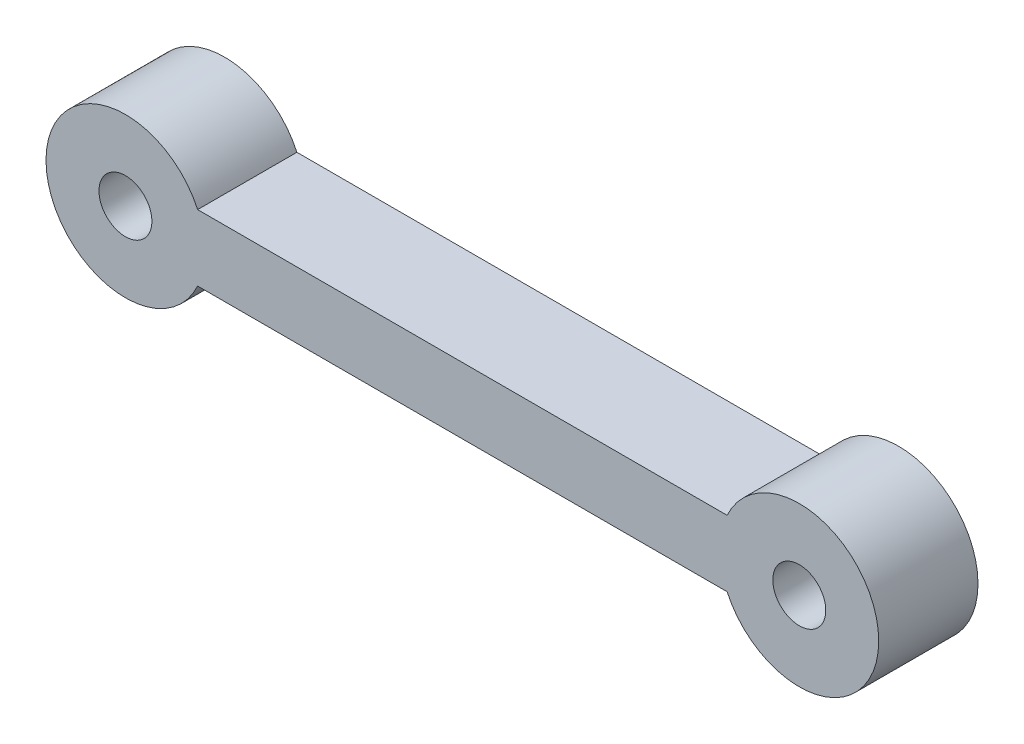
ISO-10303-21;
HEADER;
FILE_DESCRIPTION(('STEP AP214'),'2;1');
FILE_NAME('part.step','',(''),(''),'','','');
FILE_SCHEMA(('AUTOMOTIVE_DESIGN { 1 0 10303 214 1 1 1 1 }'));
ENDSEC;
DATA;
#1=APPLICATION_CONTEXT('core data for automotive mechanical design processes');
#2=APPLICATION_PROTOCOL_DEFINITION('international standard','automotive_design',2000,#1);
#3=PRODUCT_CONTEXT('',#1,'mechanical');
#4=PRODUCT('Part','Part','',(#3));
#5=PRODUCT_RELATED_PRODUCT_CATEGORY('part','',(#4));
#6=PRODUCT_DEFINITION_FORMATION('','',#4);
#7=PRODUCT_DEFINITION_CONTEXT('part definition',#1,'design');
#8=PRODUCT_DEFINITION('design','',#6,#7);
#9=PRODUCT_DEFINITION_SHAPE('','',#8);
#10=(LENGTH_UNIT() NAMED_UNIT(*) SI_UNIT(.MILLI.,.METRE.));
#11=(NAMED_UNIT(*) PLANE_ANGLE_UNIT() SI_UNIT($,.RADIAN.));
#12=(NAMED_UNIT(*) SI_UNIT($,.STERADIAN.) SOLID_ANGLE_UNIT());
#13=UNCERTAINTY_MEASURE_WITH_UNIT(LENGTH_MEASURE(1.E-05),#10,'distance_accuracy_value','');
#14=(GEOMETRIC_REPRESENTATION_CONTEXT(3) GLOBAL_UNCERTAINTY_ASSIGNED_CONTEXT((#13)) GLOBAL_UNIT_ASSIGNED_CONTEXT((#10,
#11,#12)) REPRESENTATION_CONTEXT('',''));
#15=CARTESIAN_POINT('',(0.,0.,0.));
#16=DIRECTION('',(0.,0.,1.));
#17=DIRECTION('',(1.,0.,0.));
#18=AXIS2_PLACEMENT_3D('',#15,#16,#17);
#19=CARTESIAN_POINT('',(-50.9087121146357,-5.00000000000001,15.));
#20=DIRECTION('',(0.,0.,1.));
#21=DIRECTION('',(1.,0.,0.));
#22=AXIS2_PLACEMENT_3D('',#19,#20,#21);
#23=PLANE('',#22);
#24=CARTESIAN_POINT('',(-50.9087121146357,-5.00000000000001,15.));
#25=DIRECTION('',(0.,0.,1.));
#26=DIRECTION('',(1.,0.,0.));
#27=AXIS2_PLACEMENT_3D('',#24,#25,#26);
#28=CIRCLE('',#27,4.);
#29=CARTESIAN_POINT('',(-46.9087121146357,-5.00000000000001,15.));
#30=VERTEX_POINT('',#29);
#31=EDGE_CURVE('E101',#30,#30,#28,.T.);
#32=ORIENTED_EDGE('',*,*,#31,.F.);
#33=EDGE_LOOP('',(#32));
#34=FACE_BOUND('',#33,.T.);
#35=CARTESIAN_POINT('',(-50.9087121146357,-5.00000000000001,15.));
#36=DIRECTION('',(0.,0.,1.));
#37=DIRECTION('',(1.,0.,0.));
#38=AXIS2_PLACEMENT_3D('',#35,#36,#37);
#39=CIRCLE('',#38,12.);
#40=CARTESIAN_POINT('',(-40.,0.,15.));
#41=VERTEX_POINT('',#40);
#42=CARTESIAN_POINT('',(-40.,-10.,15.));
#43=VERTEX_POINT('',#42);
#44=EDGE_CURVE('E86',#41,#43,#39,.T.);
#45=ORIENTED_EDGE('',*,*,#44,.T.);
#46=DIRECTION('',(1.,0.,0.));
#47=VECTOR('',#46,1.);
#48=CARTESIAN_POINT('',(-40.,-10.,15.));
#49=LINE('',#48,#47);
#50=CARTESIAN_POINT('',(40.,-10.,15.));
#51=VERTEX_POINT('',#50);
#52=EDGE_CURVE('E81',#43,#51,#49,.T.);
#53=ORIENTED_EDGE('',*,*,#52,.T.);
#54=CARTESIAN_POINT('',(50.9087121146357,-5.00000000000001,15.));
#55=DIRECTION('',(0.,0.,1.));
#56=DIRECTION('',(-1.,0.,0.));
#57=AXIS2_PLACEMENT_3D('',#54,#55,#56);
#58=CIRCLE('',#57,12.);
#59=CARTESIAN_POINT('',(40.,0.,15.));
#60=VERTEX_POINT('',#59);
#61=EDGE_CURVE('E84',#51,#60,#58,.T.);
#62=ORIENTED_EDGE('',*,*,#61,.T.);
#63=DIRECTION('',(-1.,0.,0.));
#64=VECTOR('',#63,1.);
#65=CARTESIAN_POINT('',(40.,0.,15.));
#66=LINE('',#65,#64);
#67=EDGE_CURVE('E51',#60,#41,#66,.T.);
#68=ORIENTED_EDGE('',*,*,#67,.T.);
#69=EDGE_LOOP('',(#45,#53,#62,#68));
#70=FACE_BOUND('',#69,.T.);
#71=CARTESIAN_POINT('',(50.9087121146357,-5.00000000000001,15.));
#72=DIRECTION('',(0.,0.,1.));
#73=DIRECTION('',(-1.,0.,0.));
#74=AXIS2_PLACEMENT_3D('',#71,#72,#73);
#75=CIRCLE('',#74,4.);
#76=CARTESIAN_POINT('',(46.9087121146357,-5.00000000000001,15.));
#77=VERTEX_POINT('',#76);
#78=EDGE_CURVE('E116',#77,#77,#75,.T.);
#79=ORIENTED_EDGE('',*,*,#78,.F.);
#80=EDGE_LOOP('',(#79));
#81=FACE_BOUND('',#80,.T.);
#82=ADVANCED_FACE('F34',(#34,#70,#81),#23,.T.);
#83=CARTESIAN_POINT('',(-50.9087121146357,-5.00000000000001,0.));
#84=DIRECTION('',(0.,0.,1.));
#85=DIRECTION('',(1.,0.,0.));
#86=AXIS2_PLACEMENT_3D('',#83,#84,#85);
#87=PLANE('',#86);
#88=CARTESIAN_POINT('',(-50.9087121146357,-5.00000000000001,0.));
#89=DIRECTION('',(0.,0.,1.));
#90=DIRECTION('',(1.,0.,0.));
#91=AXIS2_PLACEMENT_3D('',#88,#89,#90);
#92=CIRCLE('',#91,12.);
#93=CARTESIAN_POINT('',(-40.,0.,0.));
#94=VERTEX_POINT('',#93);
#95=CARTESIAN_POINT('',(-40.,-10.,0.));
#96=VERTEX_POINT('',#95);
#97=EDGE_CURVE('E98',#94,#96,#92,.T.);
#98=ORIENTED_EDGE('',*,*,#97,.F.);
#99=DIRECTION('',(-1.,0.,0.));
#100=VECTOR('',#99,1.);
#101=CARTESIAN_POINT('',(40.,0.,0.));
#102=LINE('',#101,#100);
#103=CARTESIAN_POINT('',(40.,0.,0.));
#104=VERTEX_POINT('',#103);
#105=EDGE_CURVE('E74',#104,#94,#102,.T.);
#106=ORIENTED_EDGE('',*,*,#105,.F.);
#107=CARTESIAN_POINT('',(50.9087121146357,-5.00000000000001,0.));
#108=DIRECTION('',(0.,0.,1.));
#109=DIRECTION('',(-1.,0.,0.));
#110=AXIS2_PLACEMENT_3D('',#107,#108,#109);
#111=CIRCLE('',#110,12.);
#112=CARTESIAN_POINT('',(40.,-10.,0.));
#113=VERTEX_POINT('',#112);
#114=EDGE_CURVE('E68',#113,#104,#111,.T.);
#115=ORIENTED_EDGE('',*,*,#114,.F.);
#116=DIRECTION('',(1.,0.,0.));
#117=VECTOR('',#116,1.);
#118=CARTESIAN_POINT('',(-40.,-10.,0.));
#119=LINE('',#118,#117);
#120=EDGE_CURVE('E90',#96,#113,#119,.T.);
#121=ORIENTED_EDGE('',*,*,#120,.F.);
#122=EDGE_LOOP('',(#98,#106,#115,#121));
#123=FACE_BOUND('',#122,.T.);
#124=CARTESIAN_POINT('',(-50.9087121146357,-5.00000000000001,0.));
#125=DIRECTION('',(0.,0.,1.));
#126=DIRECTION('',(1.,0.,0.));
#127=AXIS2_PLACEMENT_3D('',#124,#125,#126);
#128=CIRCLE('',#127,4.);
#129=CARTESIAN_POINT('',(-46.9087121146357,-5.00000000000001,0.));
#130=VERTEX_POINT('',#129);
#131=EDGE_CURVE('E113',#130,#130,#128,.T.);
#132=ORIENTED_EDGE('',*,*,#131,.T.);
#133=EDGE_LOOP('',(#132));
#134=FACE_BOUND('',#133,.T.);
#135=CARTESIAN_POINT('',(50.9087121146357,-5.00000000000001,0.));
#136=DIRECTION('',(0.,0.,1.));
#137=DIRECTION('',(-1.,0.,0.));
#138=AXIS2_PLACEMENT_3D('',#135,#136,#137);
#139=CIRCLE('',#138,4.);
#140=CARTESIAN_POINT('',(46.9087121146357,-5.00000000000001,0.));
#141=VERTEX_POINT('',#140);
#142=EDGE_CURVE('E119',#141,#141,#139,.T.);
#143=ORIENTED_EDGE('',*,*,#142,.T.);
#144=EDGE_LOOP('',(#143));
#145=FACE_BOUND('',#144,.T.);
#146=ADVANCED_FACE('F109',(#123,#134,#145),#87,.F.);
#147=CARTESIAN_POINT('',(-50.9087121146357,-5.00000000000001,15.));
#148=DIRECTION('',(0.,0.,-1.));
#149=DIRECTION('',(-1.,0.,0.));
#150=AXIS2_PLACEMENT_3D('',#147,#148,#149);
#151=CYLINDRICAL_SURFACE('',#150,12.);
#152=ORIENTED_EDGE('',*,*,#97,.T.);
#153=DIRECTION('',(0.,0.,-1.));
#154=VECTOR('',#153,1.);
#155=CARTESIAN_POINT('',(-40.,-10.,15.));
#156=LINE('',#155,#154);
#157=EDGE_CURVE('E11',#43,#96,#156,.T.);
#158=ORIENTED_EDGE('',*,*,#157,.F.);
#159=ORIENTED_EDGE('',*,*,#44,.F.);
#160=DIRECTION('',(0.,0.,-1.));
#161=VECTOR('',#160,1.);
#162=CARTESIAN_POINT('',(-40.,0.,15.));
#163=LINE('',#162,#161);
#164=EDGE_CURVE('E94',#41,#94,#163,.T.);
#165=ORIENTED_EDGE('',*,*,#164,.T.);
#166=EDGE_LOOP('',(#152,#158,#159,#165));
#167=FACE_BOUND('',#166,.T.);
#168=ADVANCED_FACE('F36',(#167),#151,.T.);
#169=CARTESIAN_POINT('',(-40.,-10.,15.));
#170=DIRECTION('',(0.,1.,0.));
#171=DIRECTION('',(0.,0.,1.));
#172=AXIS2_PLACEMENT_3D('',#169,#170,#171);
#173=PLANE('',#172);
#174=ORIENTED_EDGE('',*,*,#120,.T.);
#175=DIRECTION('',(0.,0.,-1.));
#176=VECTOR('',#175,1.);
#177=CARTESIAN_POINT('',(40.,-10.,15.));
#178=LINE('',#177,#176);
#179=EDGE_CURVE('E43',#51,#113,#178,.T.);
#180=ORIENTED_EDGE('',*,*,#179,.F.);
#181=ORIENTED_EDGE('',*,*,#52,.F.);
#182=ORIENTED_EDGE('',*,*,#157,.T.);
#183=EDGE_LOOP('',(#174,#180,#181,#182));
#184=FACE_BOUND('',#183,.T.);
#185=ADVANCED_FACE('F89',(#184),#173,.F.);
#186=CARTESIAN_POINT('',(50.9087121146357,-5.00000000000001,15.));
#187=DIRECTION('',(0.,0.,-1.));
#188=DIRECTION('',(-1.,0.,0.));
#189=AXIS2_PLACEMENT_3D('',#186,#187,#188);
#190=CYLINDRICAL_SURFACE('',#189,12.);
#191=ORIENTED_EDGE('',*,*,#114,.T.);
#192=DIRECTION('',(0.,0.,-1.));
#193=VECTOR('',#192,1.);
#194=CARTESIAN_POINT('',(40.,0.,15.));
#195=LINE('',#194,#193);
#196=EDGE_CURVE('E91',#60,#104,#195,.T.);
#197=ORIENTED_EDGE('',*,*,#196,.F.);
#198=ORIENTED_EDGE('',*,*,#61,.F.);
#199=ORIENTED_EDGE('',*,*,#179,.T.);
#200=EDGE_LOOP('',(#191,#197,#198,#199));
#201=FACE_BOUND('',#200,.T.);
#202=ADVANCED_FACE('F92',(#201),#190,.T.);
#203=CARTESIAN_POINT('',(40.,0.,15.));
#204=DIRECTION('',(0.,-1.,0.));
#205=DIRECTION('',(0.,0.,-1.));
#206=AXIS2_PLACEMENT_3D('',#203,#204,#205);
#207=PLANE('',#206);
#208=ORIENTED_EDGE('',*,*,#105,.T.);
#209=ORIENTED_EDGE('',*,*,#164,.F.);
#210=ORIENTED_EDGE('',*,*,#67,.F.);
#211=ORIENTED_EDGE('',*,*,#196,.T.);
#212=EDGE_LOOP('',(#208,#209,#210,#211));
#213=FACE_BOUND('',#212,.T.);
#214=ADVANCED_FACE('F106',(#213),#207,.F.);
#215=CARTESIAN_POINT('',(-50.9087121146357,-5.00000000000001,15.));
#216=DIRECTION('',(0.,0.,-1.));
#217=DIRECTION('',(-1.,0.,0.));
#218=AXIS2_PLACEMENT_3D('',#215,#216,#217);
#219=CYLINDRICAL_SURFACE('',#218,4.);
#220=ORIENTED_EDGE('',*,*,#31,.T.);
#221=EDGE_LOOP('',(#220));
#222=FACE_BOUND('',#221,.T.);
#223=ORIENTED_EDGE('',*,*,#131,.F.);
#224=EDGE_LOOP('',(#223));
#225=FACE_BOUND('',#224,.T.);
#226=ADVANCED_FACE('F136',(#222,#225),#219,.F.);
#227=CARTESIAN_POINT('',(50.9087121146357,-5.00000000000001,15.));
#228=DIRECTION('',(0.,0.,-1.));
#229=DIRECTION('',(-1.,0.,0.));
#230=AXIS2_PLACEMENT_3D('',#227,#228,#229);
#231=CYLINDRICAL_SURFACE('',#230,4.);
#232=ORIENTED_EDGE('',*,*,#78,.T.);
#233=EDGE_LOOP('',(#232));
#234=FACE_BOUND('',#233,.T.);
#235=ORIENTED_EDGE('',*,*,#142,.F.);
#236=EDGE_LOOP('',(#235));
#237=FACE_BOUND('',#236,.T.);
#238=ADVANCED_FACE('F125',(#234,#237),#231,.F.);
#239=CLOSED_SHELL('',(#82,#146,#168,#185,#202,#214,#226,#238));
#240=MANIFOLD_SOLID_BREP('B2',#239);
#241=ADVANCED_BREP_SHAPE_REPRESENTATION('',(#18,#240),#14);
#242=SHAPE_DEFINITION_REPRESENTATION(#9,#241);
ENDSEC;
END-ISO-10303-21;
